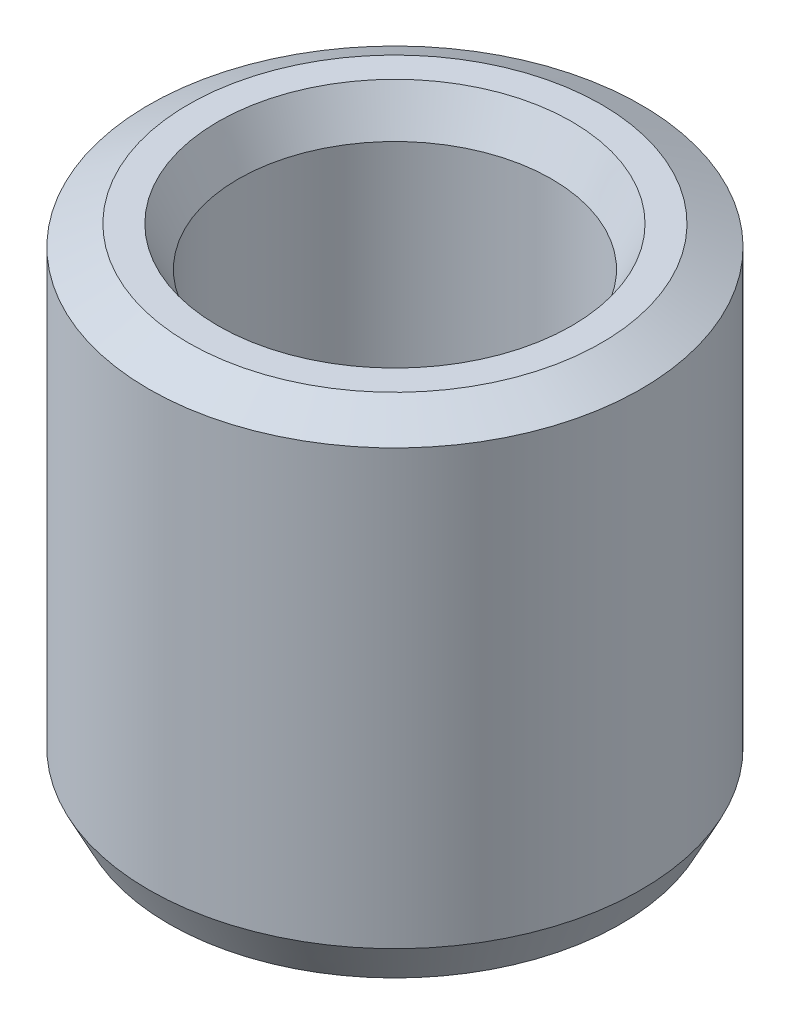
ISO-10303-21;
HEADER;
FILE_DESCRIPTION(('STEP AP214'),'2;1');
FILE_NAME('part.step','',(''),(''),'','','');
FILE_SCHEMA(('AUTOMOTIVE_DESIGN { 1 0 10303 214 1 1 1 1 }'));
ENDSEC;
DATA;
#1=APPLICATION_CONTEXT('core data for automotive mechanical design processes');
#2=APPLICATION_PROTOCOL_DEFINITION('international standard','automotive_design',2000,#1);
#3=PRODUCT_CONTEXT('',#1,'mechanical');
#4=PRODUCT('Part','Part','',(#3));
#5=PRODUCT_RELATED_PRODUCT_CATEGORY('part','',(#4));
#6=PRODUCT_DEFINITION_FORMATION('','',#4);
#7=PRODUCT_DEFINITION_CONTEXT('part definition',#1,'design');
#8=PRODUCT_DEFINITION('design','',#6,#7);
#9=PRODUCT_DEFINITION_SHAPE('','',#8);
#10=(LENGTH_UNIT() NAMED_UNIT(*) SI_UNIT(.MILLI.,.METRE.));
#11=(NAMED_UNIT(*) PLANE_ANGLE_UNIT() SI_UNIT($,.RADIAN.));
#12=(NAMED_UNIT(*) SI_UNIT($,.STERADIAN.) SOLID_ANGLE_UNIT());
#13=UNCERTAINTY_MEASURE_WITH_UNIT(LENGTH_MEASURE(1.E-05),#10,'distance_accuracy_value','');
#14=(GEOMETRIC_REPRESENTATION_CONTEXT(3) GLOBAL_UNCERTAINTY_ASSIGNED_CONTEXT((#13)) GLOBAL_UNIT_ASSIGNED_CONTEXT((#10,
#11,#12)) REPRESENTATION_CONTEXT('',''));
#15=CARTESIAN_POINT('',(0.,0.,0.));
#16=DIRECTION('',(0.,0.,1.));
#17=DIRECTION('',(1.,0.,0.));
#18=AXIS2_PLACEMENT_3D('',#15,#16,#17);
#19=CARTESIAN_POINT('',(0.,75.175865000281,0.));
#20=DIRECTION('',(0.,-1.,0.));
#21=DIRECTION('',(0.,0.,-1.));
#22=AXIS2_PLACEMENT_3D('',#19,#20,#21);
#23=CYLINDRICAL_SURFACE('',#22,37.5);
#24=CARTESIAN_POINT('',(0.,6.03546522267162,0.));
#25=DIRECTION('',(0.,1.,0.));
#26=DIRECTION('',(0.,0.,1.));
#27=AXIS2_PLACEMENT_3D('',#24,#25,#26);
#28=CIRCLE('',#27,37.5);
#29=CARTESIAN_POINT('',(0.,6.03546522267162,37.5));
#30=VERTEX_POINT('',#29);
#31=EDGE_CURVE('E10',#30,#30,#28,.T.);
#32=ORIENTED_EDGE('',*,*,#31,.T.);
#33=EDGE_LOOP('',(#32));
#34=FACE_BOUND('',#33,.T.);
#35=CARTESIAN_POINT('',(0.,72.1024134375326,0.));
#36=DIRECTION('',(0.,1.,0.));
#37=DIRECTION('',(0.,0.,1.));
#38=AXIS2_PLACEMENT_3D('',#35,#36,#37);
#39=CIRCLE('',#38,37.5);
#40=CARTESIAN_POINT('',(0.,72.1024134375326,37.5));
#41=VERTEX_POINT('',#40);
#42=EDGE_CURVE('E50',#41,#41,#39,.F.);
#43=ORIENTED_EDGE('',*,*,#42,.T.);
#44=EDGE_LOOP('',(#43));
#45=FACE_BOUND('',#44,.T.);
#46=ADVANCED_FACE('F39',(#34,#45),#23,.T.);
#47=CARTESIAN_POINT('',(0.,75.175865000281,0.));
#48=DIRECTION('',(0.,1.,0.));
#49=DIRECTION('',(0.,0.,1.));
#50=AXIS2_PLACEMENT_3D('',#47,#48,#49);
#51=PLANE('',#50);
#52=CARTESIAN_POINT('',(0.,75.175865000281,0.));
#53=DIRECTION('',(0.,1.,0.));
#54=DIRECTION('',(0.,0.,1.));
#55=AXIS2_PLACEMENT_3D('',#52,#53,#54);
#56=CIRCLE('',#55,26.9441275791955);
#57=CARTESIAN_POINT('',(0.,75.175865000281,26.9441275791955));
#58=VERTEX_POINT('',#57);
#59=EDGE_CURVE('E58',#58,#58,#56,.F.);
#60=ORIENTED_EDGE('',*,*,#59,.T.);
#61=EDGE_LOOP('',(#60));
#62=FACE_BOUND('',#61,.T.);
#63=CARTESIAN_POINT('',(0.,75.175865000281,0.));
#64=DIRECTION('',(0.,1.,0.));
#65=DIRECTION('',(0.,0.,1.));
#66=AXIS2_PLACEMENT_3D('',#63,#64,#65);
#67=CIRCLE('',#66,31.4645347773284);
#68=CARTESIAN_POINT('',(0.,75.175865000281,31.4645347773284));
#69=VERTEX_POINT('',#68);
#70=EDGE_CURVE('E61',#69,#69,#67,.T.);
#71=ORIENTED_EDGE('',*,*,#70,.T.);
#72=EDGE_LOOP('',(#71));
#73=FACE_BOUND('',#72,.T.);
#74=ADVANCED_FACE('F88',(#62,#73),#51,.T.);
#75=CARTESIAN_POINT('',(0.,0.,0.));
#76=DIRECTION('',(0.,1.,0.));
#77=DIRECTION('',(0.,0.,1.));
#78=AXIS2_PLACEMENT_3D('',#75,#76,#77);
#79=PLANE('',#78);
#80=CARTESIAN_POINT('',(0.,0.,0.));
#81=DIRECTION('',(0.,1.,0.));
#82=DIRECTION('',(0.,0.,1.));
#83=AXIS2_PLACEMENT_3D('',#80,#81,#82);
#84=CIRCLE('',#83,29.9061412391187);
#85=CARTESIAN_POINT('',(0.,0.,29.9061412391187));
#86=VERTEX_POINT('',#85);
#87=EDGE_CURVE('E51',#86,#86,#84,.T.);
#88=ORIENTED_EDGE('',*,*,#87,.T.);
#89=EDGE_LOOP('',(#88));
#90=FACE_BOUND('',#89,.T.);
#91=CARTESIAN_POINT('',(0.,0.,0.));
#92=DIRECTION('',(0.,1.,0.));
#93=DIRECTION('',(0.,0.,1.));
#94=AXIS2_PLACEMENT_3D('',#91,#92,#93);
#95=CIRCLE('',#94,34.4265484372516);
#96=CARTESIAN_POINT('',(0.,0.,34.4265484372516));
#97=VERTEX_POINT('',#96);
#98=EDGE_CURVE('E54',#97,#97,#95,.F.);
#99=ORIENTED_EDGE('',*,*,#98,.T.);
#100=EDGE_LOOP('',(#99));
#101=FACE_BOUND('',#100,.T.);
#102=ADVANCED_FACE('F83',(#90,#101),#79,.F.);
#103=CARTESIAN_POINT('',(0.,75.175865000281,0.));
#104=DIRECTION('',(0.,-1.,0.));
#105=DIRECTION('',(0.,0.,-1.));
#106=AXIS2_PLACEMENT_3D('',#103,#104,#105);
#107=CYLINDRICAL_SURFACE('',#106,23.8706760164471);
#108=CARTESIAN_POINT('',(0.,69.1403997776095,0.));
#109=DIRECTION('',(0.,1.,0.));
#110=DIRECTION('',(0.,0.,1.));
#111=AXIS2_PLACEMENT_3D('',#108,#109,#110);
#112=CIRCLE('',#111,23.8706760164471);
#113=CARTESIAN_POINT('',(0.,69.1403997776095,23.8706760164471));
#114=VERTEX_POINT('',#113);
#115=EDGE_CURVE('E67',#114,#114,#112,.T.);
#116=ORIENTED_EDGE('',*,*,#115,.T.);
#117=EDGE_LOOP('',(#116));
#118=FACE_BOUND('',#117,.T.);
#119=CARTESIAN_POINT('',(0.,3.07345156274842,0.));
#120=DIRECTION('',(0.,1.,0.));
#121=DIRECTION('',(0.,0.,1.));
#122=AXIS2_PLACEMENT_3D('',#119,#120,#121);
#123=CIRCLE('',#122,23.8706760164471);
#124=CARTESIAN_POINT('',(0.,3.07345156274842,23.8706760164471));
#125=VERTEX_POINT('',#124);
#126=EDGE_CURVE('E69',#125,#125,#123,.F.);
#127=ORIENTED_EDGE('',*,*,#126,.T.);
#128=EDGE_LOOP('',(#127));
#129=FACE_BOUND('',#128,.T.);
#130=ADVANCED_FACE('F71',(#118,#129),#107,.F.);
#131=CARTESIAN_POINT('',(0.,69.1403997776095,0.));
#132=DIRECTION('',(0.,1.,0.));
#133=DIRECTION('',(0.,0.,1.));
#134=AXIS2_PLACEMENT_3D('',#131,#132,#133);
#135=CONICAL_SURFACE('',#134,23.8706760164471,0.471005842010401);
#136=ORIENTED_EDGE('',*,*,#59,.F.);
#137=EDGE_LOOP('',(#136));
#138=FACE_BOUND('',#137,.T.);
#139=ORIENTED_EDGE('',*,*,#115,.F.);
#140=EDGE_LOOP('',(#139));
#141=FACE_BOUND('',#140,.T.);
#142=ADVANCED_FACE('F77',(#138,#141),#135,.F.);
#143=CARTESIAN_POINT('',(0.,0.,0.));
#144=DIRECTION('',(0.,-1.,0.));
#145=DIRECTION('',(0.,0.,-1.));
#146=AXIS2_PLACEMENT_3D('',#143,#144,#145);
#147=CONICAL_SURFACE('',#146,29.9061412391187,1.0997904847845);
#148=ORIENTED_EDGE('',*,*,#126,.F.);
#149=EDGE_LOOP('',(#148));
#150=FACE_BOUND('',#149,.T.);
#151=ORIENTED_EDGE('',*,*,#87,.F.);
#152=EDGE_LOOP('',(#151));
#153=FACE_BOUND('',#152,.T.);
#154=ADVANCED_FACE('F73',(#150,#153),#147,.F.);
#155=CARTESIAN_POINT('',(0.,6.03546522267162,0.));
#156=DIRECTION('',(0.,1.,0.));
#157=DIRECTION('',(0.,0.,1.));
#158=AXIS2_PLACEMENT_3D('',#155,#156,#157);
#159=CONICAL_SURFACE('',#158,37.5,0.471005842010401);
#160=ORIENTED_EDGE('',*,*,#98,.F.);
#161=EDGE_LOOP('',(#160));
#162=FACE_BOUND('',#161,.T.);
#163=ORIENTED_EDGE('',*,*,#31,.F.);
#164=EDGE_LOOP('',(#163));
#165=FACE_BOUND('',#164,.T.);
#166=ADVANCED_FACE('F76',(#162,#165),#159,.T.);
#167=CARTESIAN_POINT('',(0.,75.175865000281,0.));
#168=DIRECTION('',(0.,-1.,0.));
#169=DIRECTION('',(0.,0.,-1.));
#170=AXIS2_PLACEMENT_3D('',#167,#168,#169);
#171=CONICAL_SURFACE('',#170,31.4645347773284,1.09979048478449);
#172=ORIENTED_EDGE('',*,*,#42,.F.);
#173=EDGE_LOOP('',(#172));
#174=FACE_BOUND('',#173,.T.);
#175=ORIENTED_EDGE('',*,*,#70,.F.);
#176=EDGE_LOOP('',(#175));
#177=FACE_BOUND('',#176,.T.);
#178=ADVANCED_FACE('F45',(#174,#177),#171,.T.);
#179=CLOSED_SHELL('',(#46,#74,#102,#130,#142,#154,#166,#178));
#180=MANIFOLD_SOLID_BREP('B2',#179);
#181=ADVANCED_BREP_SHAPE_REPRESENTATION('',(#18,#180),#14);
#182=SHAPE_DEFINITION_REPRESENTATION(#9,#181);
ENDSEC;
END-ISO-10303-21;
